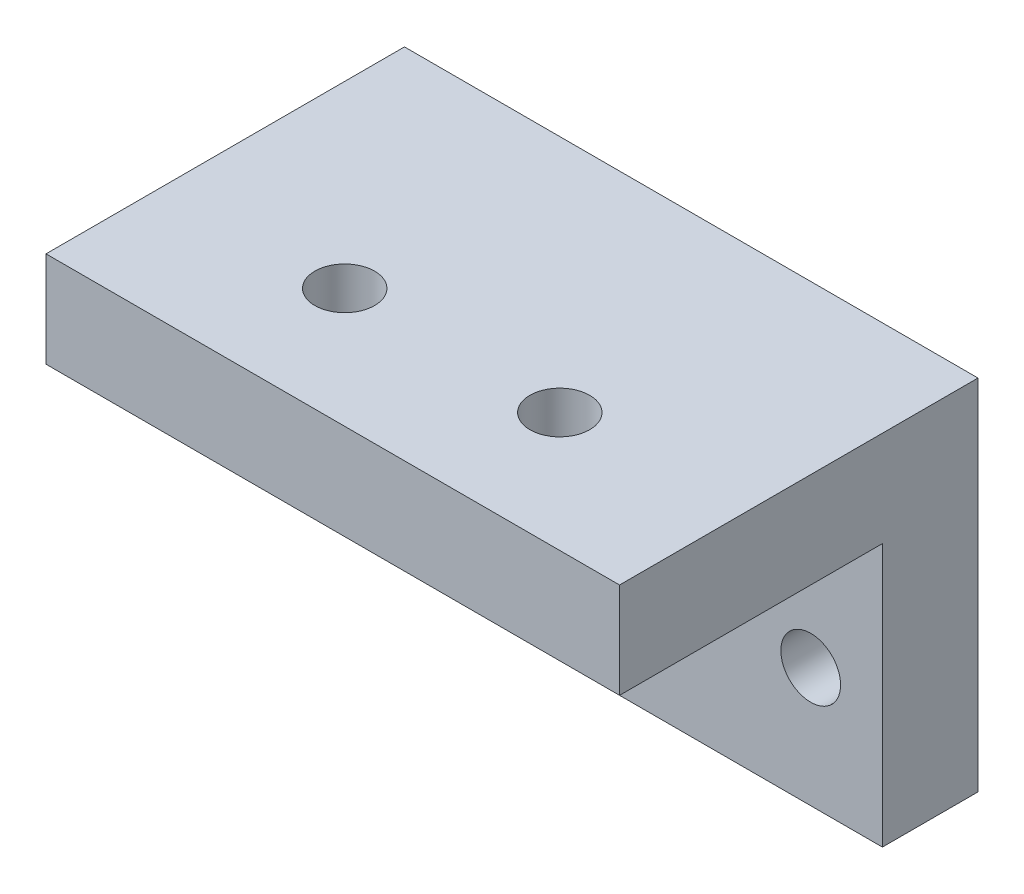
ISO-10303-21;
HEADER;
FILE_DESCRIPTION(('STEP AP214'),'2;1');
FILE_NAME('part.step','',(''),(''),'','','');
FILE_SCHEMA(('AUTOMOTIVE_DESIGN { 1 0 10303 214 1 1 1 1 }'));
ENDSEC;
DATA;
#1=APPLICATION_CONTEXT('core data for automotive mechanical design processes');
#2=APPLICATION_PROTOCOL_DEFINITION('international standard','automotive_design',2000,#1);
#3=PRODUCT_CONTEXT('',#1,'mechanical');
#4=PRODUCT('Part','Part','',(#3));
#5=PRODUCT_RELATED_PRODUCT_CATEGORY('part','',(#4));
#6=PRODUCT_DEFINITION_FORMATION('','',#4);
#7=PRODUCT_DEFINITION_CONTEXT('part definition',#1,'design');
#8=PRODUCT_DEFINITION('design','',#6,#7);
#9=PRODUCT_DEFINITION_SHAPE('','',#8);
#10=(LENGTH_UNIT() NAMED_UNIT(*) SI_UNIT(.MILLI.,.METRE.));
#11=(NAMED_UNIT(*) PLANE_ANGLE_UNIT() SI_UNIT($,.RADIAN.));
#12=(NAMED_UNIT(*) SI_UNIT($,.STERADIAN.) SOLID_ANGLE_UNIT());
#13=UNCERTAINTY_MEASURE_WITH_UNIT(LENGTH_MEASURE(1.E-05),#10,'distance_accuracy_value','');
#14=(GEOMETRIC_REPRESENTATION_CONTEXT(3) GLOBAL_UNCERTAINTY_ASSIGNED_CONTEXT((#13)) GLOBAL_UNIT_ASSIGNED_CONTEXT((#10,
#11,#12)) REPRESENTATION_CONTEXT('',''));
#15=CARTESIAN_POINT('',(0.,0.,0.));
#16=DIRECTION('',(0.,0.,1.));
#17=DIRECTION('',(1.,0.,0.));
#18=AXIS2_PLACEMENT_3D('',#15,#16,#17);
#19=CARTESIAN_POINT('',(12.,7.5,4.));
#20=DIRECTION('',(-1.,0.,0.));
#21=DIRECTION('',(0.,-1.,0.));
#22=AXIS2_PLACEMENT_3D('',#19,#20,#21);
#23=PLANE('',#22);
#24=DIRECTION('',(0.,1.,0.));
#25=VECTOR('',#24,1.);
#26=CARTESIAN_POINT('',(12.,7.5,0.));
#27=LINE('',#26,#25);
#28=CARTESIAN_POINT('',(12.,-7.5,0.));
#29=VERTEX_POINT('',#28);
#30=CARTESIAN_POINT('',(12.,7.5,0.));
#31=VERTEX_POINT('',#30);
#32=EDGE_CURVE('E93',#29,#31,#27,.T.);
#33=ORIENTED_EDGE('',*,*,#32,.T.);
#34=DIRECTION('',(0.,0.,-1.));
#35=VECTOR('',#34,1.);
#36=CARTESIAN_POINT('',(12.,7.5,4.));
#37=LINE('',#36,#35);
#38=CARTESIAN_POINT('',(12.,7.5,15.));
#39=VERTEX_POINT('',#38);
#40=EDGE_CURVE('E11',#39,#31,#37,.T.);
#41=ORIENTED_EDGE('',*,*,#40,.F.);
#42=DIRECTION('',(0.,1.,0.));
#43=VECTOR('',#42,1.);
#44=CARTESIAN_POINT('',(12.,7.5,15.));
#45=LINE('',#44,#43);
#46=CARTESIAN_POINT('',(12.,3.5,15.));
#47=VERTEX_POINT('',#46);
#48=EDGE_CURVE('E129',#47,#39,#45,.T.);
#49=ORIENTED_EDGE('',*,*,#48,.F.);
#50=DIRECTION('',(0.,0.,-1.));
#51=VECTOR('',#50,1.);
#52=CARTESIAN_POINT('',(12.,3.5,15.));
#53=LINE('',#52,#51);
#54=CARTESIAN_POINT('',(12.,3.5,4.));
#55=VERTEX_POINT('',#54);
#56=EDGE_CURVE('E102',#47,#55,#53,.T.);
#57=ORIENTED_EDGE('',*,*,#56,.T.);
#58=DIRECTION('',(0.,1.,0.));
#59=VECTOR('',#58,1.);
#60=CARTESIAN_POINT('',(12.,7.5,4.));
#61=LINE('',#60,#59);
#62=CARTESIAN_POINT('',(12.,-7.5,4.));
#63=VERTEX_POINT('',#62);
#64=EDGE_CURVE('E87',#63,#55,#61,.T.);
#65=ORIENTED_EDGE('',*,*,#64,.F.);
#66=DIRECTION('',(0.,0.,-1.));
#67=VECTOR('',#66,1.);
#68=CARTESIAN_POINT('',(12.,-7.5,4.));
#69=LINE('',#68,#67);
#70=EDGE_CURVE('E80',#63,#29,#69,.T.);
#71=ORIENTED_EDGE('',*,*,#70,.T.);
#72=EDGE_LOOP('',(#33,#41,#49,#57,#65,#71));
#73=FACE_BOUND('',#72,.T.);
#74=ADVANCED_FACE('F38',(#73),#23,.F.);
#75=CARTESIAN_POINT('',(-12.,7.5,4.));
#76=DIRECTION('',(0.,-1.,0.));
#77=DIRECTION('',(0.,0.,-1.));
#78=AXIS2_PLACEMENT_3D('',#75,#76,#77);
#79=PLANE('',#78);
#80=CARTESIAN_POINT('',(-4.5,7.5,10.));
#81=DIRECTION('',(0.,-1.,0.));
#82=DIRECTION('',(0.,0.,-1.));
#83=AXIS2_PLACEMENT_3D('',#80,#81,#82);
#84=CIRCLE('',#83,1.25);
#85=CARTESIAN_POINT('',(-4.5,7.5,8.75));
#86=VERTEX_POINT('',#85);
#87=EDGE_CURVE('E153',#86,#86,#84,.T.);
#88=ORIENTED_EDGE('',*,*,#87,.T.);
#89=EDGE_LOOP('',(#88));
#90=FACE_BOUND('',#89,.T.);
#91=CARTESIAN_POINT('',(4.50000000000001,7.5,10.));
#92=DIRECTION('',(0.,-1.,0.));
#93=DIRECTION('',(0.,0.,-1.));
#94=AXIS2_PLACEMENT_3D('',#91,#92,#93);
#95=CIRCLE('',#94,1.25);
#96=CARTESIAN_POINT('',(4.50000000000001,7.5,8.75));
#97=VERTEX_POINT('',#96);
#98=EDGE_CURVE('E164',#97,#97,#95,.T.);
#99=ORIENTED_EDGE('',*,*,#98,.T.);
#100=EDGE_LOOP('',(#99));
#101=FACE_BOUND('',#100,.T.);
#102=DIRECTION('',(-1.,0.,0.));
#103=VECTOR('',#102,1.);
#104=CARTESIAN_POINT('',(-12.,7.5,0.));
#105=LINE('',#104,#103);
#106=CARTESIAN_POINT('',(-12.,7.5,0.));
#107=VERTEX_POINT('',#106);
#108=EDGE_CURVE('E97',#31,#107,#105,.T.);
#109=ORIENTED_EDGE('',*,*,#108,.T.);
#110=DIRECTION('',(0.,0.,-1.));
#111=VECTOR('',#110,1.);
#112=CARTESIAN_POINT('',(-12.,7.5,4.));
#113=LINE('',#112,#111);
#114=CARTESIAN_POINT('',(-12.,7.5,15.));
#115=VERTEX_POINT('',#114);
#116=EDGE_CURVE('E45',#115,#107,#113,.T.);
#117=ORIENTED_EDGE('',*,*,#116,.F.);
#118=DIRECTION('',(-1.,0.,0.));
#119=VECTOR('',#118,1.);
#120=CARTESIAN_POINT('',(-12.,7.5,15.));
#121=LINE('',#120,#119);
#122=EDGE_CURVE('E121',#39,#115,#121,.T.);
#123=ORIENTED_EDGE('',*,*,#122,.F.);
#124=ORIENTED_EDGE('',*,*,#40,.T.);
#125=EDGE_LOOP('',(#109,#117,#123,#124));
#126=FACE_BOUND('',#125,.T.);
#127=ADVANCED_FACE('F119',(#90,#101,#126),#79,.F.);
#128=CARTESIAN_POINT('',(-12.,7.5,4.));
#129=DIRECTION('',(1.,0.,0.));
#130=DIRECTION('',(0.,1.,0.));
#131=AXIS2_PLACEMENT_3D('',#128,#129,#130);
#132=PLANE('',#131);
#133=DIRECTION('',(0.,-1.,0.));
#134=VECTOR('',#133,1.);
#135=CARTESIAN_POINT('',(-12.,7.5,0.));
#136=LINE('',#135,#134);
#137=CARTESIAN_POINT('',(-12.,-7.5,0.));
#138=VERTEX_POINT('',#137);
#139=EDGE_CURVE('E88',#107,#138,#136,.T.);
#140=ORIENTED_EDGE('',*,*,#139,.T.);
#141=DIRECTION('',(0.,0.,-1.));
#142=VECTOR('',#141,1.);
#143=CARTESIAN_POINT('',(-12.,-7.5,4.));
#144=LINE('',#143,#142);
#145=CARTESIAN_POINT('',(-12.,-7.5,4.));
#146=VERTEX_POINT('',#145);
#147=EDGE_CURVE('E83',#146,#138,#144,.T.);
#148=ORIENTED_EDGE('',*,*,#147,.F.);
#149=DIRECTION('',(0.,-1.,0.));
#150=VECTOR('',#149,1.);
#151=CARTESIAN_POINT('',(-12.,7.5,4.));
#152=LINE('',#151,#150);
#153=CARTESIAN_POINT('',(-12.,3.5,4.));
#154=VERTEX_POINT('',#153);
#155=EDGE_CURVE('E138',#154,#146,#152,.T.);
#156=ORIENTED_EDGE('',*,*,#155,.F.);
#157=DIRECTION('',(0.,0.,-1.));
#158=VECTOR('',#157,1.);
#159=CARTESIAN_POINT('',(-12.,3.5,15.));
#160=LINE('',#159,#158);
#161=CARTESIAN_POINT('',(-12.,3.5,15.));
#162=VERTEX_POINT('',#161);
#163=EDGE_CURVE('E98',#162,#154,#160,.T.);
#164=ORIENTED_EDGE('',*,*,#163,.F.);
#165=DIRECTION('',(0.,-1.,0.));
#166=VECTOR('',#165,1.);
#167=CARTESIAN_POINT('',(-12.,7.5,15.));
#168=LINE('',#167,#166);
#169=EDGE_CURVE('E115',#115,#162,#168,.T.);
#170=ORIENTED_EDGE('',*,*,#169,.F.);
#171=ORIENTED_EDGE('',*,*,#116,.T.);
#172=EDGE_LOOP('',(#140,#148,#156,#164,#170,#171));
#173=FACE_BOUND('',#172,.T.);
#174=ADVANCED_FACE('F112',(#173),#132,.F.);
#175=CARTESIAN_POINT('',(-12.,-7.5,4.));
#176=DIRECTION('',(0.,1.,0.));
#177=DIRECTION('',(0.,0.,1.));
#178=AXIS2_PLACEMENT_3D('',#175,#176,#177);
#179=PLANE('',#178);
#180=DIRECTION('',(1.,0.,0.));
#181=VECTOR('',#180,1.);
#182=CARTESIAN_POINT('',(-12.,-7.5,0.));
#183=LINE('',#182,#181);
#184=EDGE_CURVE('E77',#138,#29,#183,.T.);
#185=ORIENTED_EDGE('',*,*,#184,.T.);
#186=ORIENTED_EDGE('',*,*,#70,.F.);
#187=DIRECTION('',(1.,0.,0.));
#188=VECTOR('',#187,1.);
#189=CARTESIAN_POINT('',(-12.,-7.5,4.));
#190=LINE('',#189,#188);
#191=EDGE_CURVE('E58',#146,#63,#190,.T.);
#192=ORIENTED_EDGE('',*,*,#191,.F.);
#193=ORIENTED_EDGE('',*,*,#147,.T.);
#194=EDGE_LOOP('',(#185,#186,#192,#193));
#195=FACE_BOUND('',#194,.T.);
#196=ADVANCED_FACE('F79',(#195),#179,.F.);
#197=CARTESIAN_POINT('',(0.,0.,4.));
#198=DIRECTION('',(0.,0.,1.));
#199=DIRECTION('',(1.,0.,0.));
#200=AXIS2_PLACEMENT_3D('',#197,#198,#199);
#201=PLANE('',#200);
#202=CARTESIAN_POINT('',(-9.,-2.5,4.));
#203=DIRECTION('',(0.,0.,1.));
#204=DIRECTION('',(1.,0.,0.));
#205=AXIS2_PLACEMENT_3D('',#202,#203,#204);
#206=CIRCLE('',#205,1.25);
#207=CARTESIAN_POINT('',(-7.75,-2.5,4.));
#208=VERTEX_POINT('',#207);
#209=EDGE_CURVE('E156',#208,#208,#206,.T.);
#210=ORIENTED_EDGE('',*,*,#209,.F.);
#211=EDGE_LOOP('',(#210));
#212=FACE_BOUND('',#211,.T.);
#213=CARTESIAN_POINT('',(9.,-2.5,4.));
#214=DIRECTION('',(0.,0.,1.));
#215=DIRECTION('',(1.,0.,0.));
#216=AXIS2_PLACEMENT_3D('',#213,#214,#215);
#217=CIRCLE('',#216,1.25);
#218=CARTESIAN_POINT('',(10.25,-2.5,4.));
#219=VERTEX_POINT('',#218);
#220=EDGE_CURVE('E149',#219,#219,#217,.T.);
#221=ORIENTED_EDGE('',*,*,#220,.F.);
#222=EDGE_LOOP('',(#221));
#223=FACE_BOUND('',#222,.T.);
#224=DIRECTION('',(1.,0.,0.));
#225=VECTOR('',#224,1.);
#226=CARTESIAN_POINT('',(-12.,3.5,4.));
#227=LINE('',#226,#225);
#228=EDGE_CURVE('E52',#154,#55,#227,.T.);
#229=ORIENTED_EDGE('',*,*,#228,.F.);
#230=ORIENTED_EDGE('',*,*,#155,.T.);
#231=ORIENTED_EDGE('',*,*,#191,.T.);
#232=ORIENTED_EDGE('',*,*,#64,.T.);
#233=EDGE_LOOP('',(#229,#230,#231,#232));
#234=FACE_BOUND('',#233,.T.);
#235=ADVANCED_FACE('F139',(#212,#223,#234),#201,.T.);
#236=CARTESIAN_POINT('',(0.,0.,0.));
#237=DIRECTION('',(0.,0.,1.));
#238=DIRECTION('',(1.,0.,0.));
#239=AXIS2_PLACEMENT_3D('',#236,#237,#238);
#240=PLANE('',#239);
#241=CARTESIAN_POINT('',(-9.,-2.5,0.));
#242=DIRECTION('',(0.,0.,1.));
#243=DIRECTION('',(1.,0.,0.));
#244=AXIS2_PLACEMENT_3D('',#241,#242,#243);
#245=CIRCLE('',#244,1.25);
#246=CARTESIAN_POINT('',(-7.75,-2.5,0.));
#247=VERTEX_POINT('',#246);
#248=EDGE_CURVE('E136',#247,#247,#245,.T.);
#249=ORIENTED_EDGE('',*,*,#248,.T.);
#250=EDGE_LOOP('',(#249));
#251=FACE_BOUND('',#250,.T.);
#252=CARTESIAN_POINT('',(9.,-2.5,0.));
#253=DIRECTION('',(0.,0.,1.));
#254=DIRECTION('',(1.,0.,0.));
#255=AXIS2_PLACEMENT_3D('',#252,#253,#254);
#256=CIRCLE('',#255,1.25);
#257=CARTESIAN_POINT('',(10.25,-2.5,0.));
#258=VERTEX_POINT('',#257);
#259=EDGE_CURVE('E152',#258,#258,#256,.T.);
#260=ORIENTED_EDGE('',*,*,#259,.T.);
#261=EDGE_LOOP('',(#260));
#262=FACE_BOUND('',#261,.T.);
#263=ORIENTED_EDGE('',*,*,#32,.F.);
#264=ORIENTED_EDGE('',*,*,#184,.F.);
#265=ORIENTED_EDGE('',*,*,#139,.F.);
#266=ORIENTED_EDGE('',*,*,#108,.F.);
#267=EDGE_LOOP('',(#263,#264,#265,#266));
#268=FACE_BOUND('',#267,.T.);
#269=ADVANCED_FACE('F96',(#251,#262,#268),#240,.F.);
#270=CARTESIAN_POINT('',(-12.,3.5,15.));
#271=DIRECTION('',(0.,1.,0.));
#272=DIRECTION('',(0.,0.,1.));
#273=AXIS2_PLACEMENT_3D('',#270,#271,#272);
#274=PLANE('',#273);
#275=CARTESIAN_POINT('',(-4.5,3.5,10.));
#276=DIRECTION('',(0.,-1.,0.));
#277=DIRECTION('',(0.,0.,-1.));
#278=AXIS2_PLACEMENT_3D('',#275,#276,#277);
#279=CIRCLE('',#278,1.25);
#280=CARTESIAN_POINT('',(-4.5,3.5,8.75));
#281=VERTEX_POINT('',#280);
#282=EDGE_CURVE('E167',#281,#281,#279,.T.);
#283=ORIENTED_EDGE('',*,*,#282,.F.);
#284=EDGE_LOOP('',(#283));
#285=FACE_BOUND('',#284,.T.);
#286=CARTESIAN_POINT('',(4.50000000000001,3.5,10.));
#287=DIRECTION('',(0.,-1.,0.));
#288=DIRECTION('',(0.,0.,-1.));
#289=AXIS2_PLACEMENT_3D('',#286,#287,#288);
#290=CIRCLE('',#289,1.25);
#291=CARTESIAN_POINT('',(4.50000000000001,3.5,8.75));
#292=VERTEX_POINT('',#291);
#293=EDGE_CURVE('E161',#292,#292,#290,.T.);
#294=ORIENTED_EDGE('',*,*,#293,.F.);
#295=EDGE_LOOP('',(#294));
#296=FACE_BOUND('',#295,.T.);
#297=ORIENTED_EDGE('',*,*,#228,.T.);
#298=ORIENTED_EDGE('',*,*,#56,.F.);
#299=DIRECTION('',(1.,0.,0.));
#300=VECTOR('',#299,1.);
#301=CARTESIAN_POINT('',(-12.,3.5,15.));
#302=LINE('',#301,#300);
#303=EDGE_CURVE('E132',#162,#47,#302,.T.);
#304=ORIENTED_EDGE('',*,*,#303,.F.);
#305=ORIENTED_EDGE('',*,*,#163,.T.);
#306=EDGE_LOOP('',(#297,#298,#304,#305));
#307=FACE_BOUND('',#306,.T.);
#308=ADVANCED_FACE('F142',(#285,#296,#307),#274,.F.);
#309=CARTESIAN_POINT('',(0.,0.,15.));
#310=DIRECTION('',(0.,0.,1.));
#311=DIRECTION('',(1.,0.,0.));
#312=AXIS2_PLACEMENT_3D('',#309,#310,#311);
#313=PLANE('',#312);
#314=ORIENTED_EDGE('',*,*,#169,.T.);
#315=ORIENTED_EDGE('',*,*,#303,.T.);
#316=ORIENTED_EDGE('',*,*,#48,.T.);
#317=ORIENTED_EDGE('',*,*,#122,.T.);
#318=EDGE_LOOP('',(#314,#315,#316,#317));
#319=FACE_BOUND('',#318,.T.);
#320=ADVANCED_FACE('F125',(#319),#313,.T.);
#321=CARTESIAN_POINT('',(9.,-2.5,0.));
#322=DIRECTION('',(0.,0.,1.));
#323=DIRECTION('',(1.,0.,0.));
#324=AXIS2_PLACEMENT_3D('',#321,#322,#323);
#325=CYLINDRICAL_SURFACE('',#324,1.25);
#326=ORIENTED_EDGE('',*,*,#259,.F.);
#327=EDGE_LOOP('',(#326));
#328=FACE_BOUND('',#327,.T.);
#329=ORIENTED_EDGE('',*,*,#220,.T.);
#330=EDGE_LOOP('',(#329));
#331=FACE_BOUND('',#330,.T.);
#332=ADVANCED_FACE('F194',(#328,#331),#325,.F.);
#333=CARTESIAN_POINT('',(-9.,-2.5,0.));
#334=DIRECTION('',(0.,0.,1.));
#335=DIRECTION('',(1.,0.,0.));
#336=AXIS2_PLACEMENT_3D('',#333,#334,#335);
#337=CYLINDRICAL_SURFACE('',#336,1.25);
#338=ORIENTED_EDGE('',*,*,#248,.F.);
#339=EDGE_LOOP('',(#338));
#340=FACE_BOUND('',#339,.T.);
#341=ORIENTED_EDGE('',*,*,#209,.T.);
#342=EDGE_LOOP('',(#341));
#343=FACE_BOUND('',#342,.T.);
#344=ADVANCED_FACE('F188',(#340,#343),#337,.F.);
#345=CARTESIAN_POINT('',(4.50000000000001,7.5,10.));
#346=DIRECTION('',(0.,-1.,0.));
#347=DIRECTION('',(0.,0.,-1.));
#348=AXIS2_PLACEMENT_3D('',#345,#346,#347);
#349=CYLINDRICAL_SURFACE('',#348,1.25);
#350=ORIENTED_EDGE('',*,*,#98,.F.);
#351=EDGE_LOOP('',(#350));
#352=FACE_BOUND('',#351,.T.);
#353=ORIENTED_EDGE('',*,*,#293,.T.);
#354=EDGE_LOOP('',(#353));
#355=FACE_BOUND('',#354,.T.);
#356=ADVANCED_FACE('F178',(#352,#355),#349,.F.);
#357=CARTESIAN_POINT('',(-4.5,7.5,10.));
#358=DIRECTION('',(0.,-1.,0.));
#359=DIRECTION('',(0.,0.,-1.));
#360=AXIS2_PLACEMENT_3D('',#357,#358,#359);
#361=CYLINDRICAL_SURFACE('',#360,1.25);
#362=ORIENTED_EDGE('',*,*,#87,.F.);
#363=EDGE_LOOP('',(#362));
#364=FACE_BOUND('',#363,.T.);
#365=ORIENTED_EDGE('',*,*,#282,.T.);
#366=EDGE_LOOP('',(#365));
#367=FACE_BOUND('',#366,.T.);
#368=ADVANCED_FACE('F175',(#364,#367),#361,.F.);
#369=CLOSED_SHELL('',(#74,#127,#174,#196,#235,#269,#308,#320,#332,#344,#356,#368));
#370=MANIFOLD_SOLID_BREP('B2',#369);
#371=ADVANCED_BREP_SHAPE_REPRESENTATION('',(#18,#370),#14);
#372=SHAPE_DEFINITION_REPRESENTATION(#9,#371);
ENDSEC;
END-ISO-10303-21;
